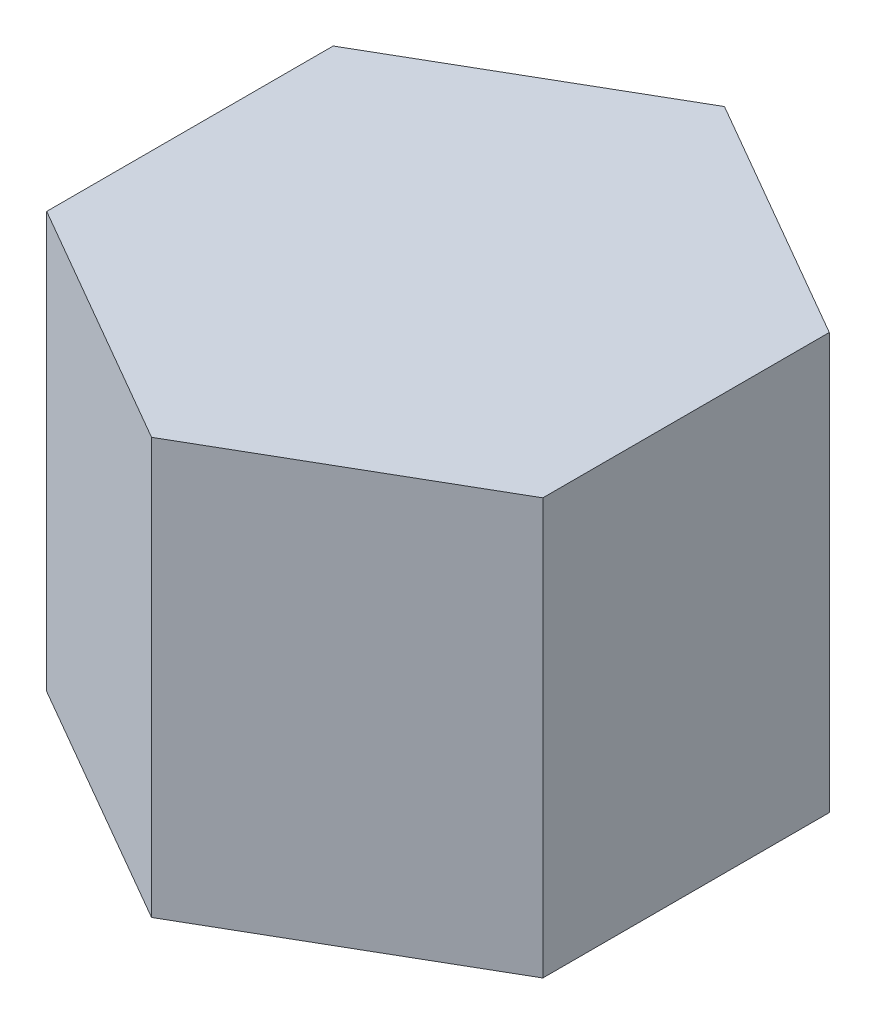
ISO-10303-21;
HEADER;
FILE_DESCRIPTION(('STEP AP214'),'2;1');
FILE_NAME('part.step','',(''),(''),'','','');
FILE_SCHEMA(('AUTOMOTIVE_DESIGN { 1 0 10303 214 1 1 1 1 }'));
ENDSEC;
DATA;
#1=APPLICATION_CONTEXT('core data for automotive mechanical design processes');
#2=APPLICATION_PROTOCOL_DEFINITION('international standard','automotive_design',2000,#1);
#3=PRODUCT_CONTEXT('',#1,'mechanical');
#4=PRODUCT('Part','Part','',(#3));
#5=PRODUCT_RELATED_PRODUCT_CATEGORY('part','',(#4));
#6=PRODUCT_DEFINITION_FORMATION('','',#4);
#7=PRODUCT_DEFINITION_CONTEXT('part definition',#1,'design');
#8=PRODUCT_DEFINITION('design','',#6,#7);
#9=PRODUCT_DEFINITION_SHAPE('','',#8);
#10=(LENGTH_UNIT() NAMED_UNIT(*) SI_UNIT(.MILLI.,.METRE.));
#11=(NAMED_UNIT(*) PLANE_ANGLE_UNIT() SI_UNIT($,.RADIAN.));
#12=(NAMED_UNIT(*) SI_UNIT($,.STERADIAN.) SOLID_ANGLE_UNIT());
#13=UNCERTAINTY_MEASURE_WITH_UNIT(LENGTH_MEASURE(1.E-05),#10,'distance_accuracy_value','');
#14=(GEOMETRIC_REPRESENTATION_CONTEXT(3) GLOBAL_UNCERTAINTY_ASSIGNED_CONTEXT((#13)) GLOBAL_UNIT_ASSIGNED_CONTEXT((#10,
#11,#12)) REPRESENTATION_CONTEXT('',''));
#15=CARTESIAN_POINT('',(0.,0.,0.));
#16=DIRECTION('',(0.,0.,1.));
#17=DIRECTION('',(1.,0.,0.));
#18=AXIS2_PLACEMENT_3D('',#15,#16,#17);
#19=CARTESIAN_POINT('',(202.642660308706,-148.537700895744,293.239022028063));
#20=DIRECTION('',(-0.500000000000028,0.,-0.866025403784423));
#21=DIRECTION('',(-0.866025403784423,0.,0.500000000000028));
#22=AXIS2_PLACEMENT_3D('',#19,#20,#21);
#23=PLANE('',#22);
#24=CARTESIAN_POINT('',(202.339551417382,-149.045793579175,293.414022028063));
#25=DIRECTION('',(0.866025403784422,0.,-0.500000000000028));
#26=VECTOR('',#25,1.);
#27=LINE('',#24,#26);
#28=CARTESIAN_POINT('',(202.339551417382,-149.045793579175,293.414022028063));
#29=VERTEX_POINT('',#28);
#30=CARTESIAN_POINT('',(202.642660308706,-149.045793579175,293.239022028063));
#31=VERTEX_POINT('',#30);
#32=EDGE_CURVE('E170',#29,#31,#27,.T.);
#33=ORIENTED_EDGE('',*,*,#32,.T.);
#34=CARTESIAN_POINT('',(202.642660308706,-148.537700895744,293.239022028063));
#35=DIRECTION('',(0.,-1.,0.));
#36=VECTOR('',#35,1.);
#37=LINE('',#34,#36);
#38=CARTESIAN_POINT('',(202.642660308706,-148.537700895744,293.239022028063));
#39=VERTEX_POINT('',#38);
#40=EDGE_CURVE('E35',#39,#31,#37,.T.);
#41=ORIENTED_EDGE('',*,*,#40,.F.);
#42=CARTESIAN_POINT('',(202.339551417382,-148.537700895744,293.414022028063));
#43=DIRECTION('',(0.866025403784422,0.,-0.500000000000028));
#44=VECTOR('',#43,1.);
#45=LINE('',#42,#44);
#46=CARTESIAN_POINT('',(202.339551417382,-148.537700895744,293.414022028063));
#47=VERTEX_POINT('',#46);
#48=EDGE_CURVE('E159',#47,#39,#45,.T.);
#49=ORIENTED_EDGE('',*,*,#48,.F.);
#50=CARTESIAN_POINT('',(202.339551417382,-148.537700895744,293.414022028063));
#51=DIRECTION('',(0.,-1.,0.));
#52=VECTOR('',#51,1.);
#53=LINE('',#50,#52);
#54=EDGE_CURVE('E10',#47,#29,#53,.T.);
#55=ORIENTED_EDGE('',*,*,#54,.T.);
#56=EDGE_LOOP('',(#33,#41,#49,#55));
#57=FACE_BOUND('',#56,.T.);
#58=ADVANCED_FACE('F16',(#57),#23,.F.);
#59=CARTESIAN_POINT('',(202.339551417382,-148.537700895744,293.414022028063));
#60=DIRECTION('',(0.499999999999978,0.,-0.866025403784452));
#61=DIRECTION('',(-0.866025403784452,0.,-0.499999999999978));
#62=AXIS2_PLACEMENT_3D('',#59,#60,#61);
#63=PLANE('',#62);
#64=CARTESIAN_POINT('',(202.036442526057,-149.045793579175,293.239022028063));
#65=DIRECTION('',(0.866025403784452,0.,0.499999999999978));
#66=VECTOR('',#65,1.);
#67=LINE('',#64,#66);
#68=CARTESIAN_POINT('',(202.036442526057,-149.045793579175,293.239022028063));
#69=VERTEX_POINT('',#68);
#70=EDGE_CURVE('E167',#69,#29,#67,.T.);
#71=ORIENTED_EDGE('',*,*,#70,.T.);
#72=ORIENTED_EDGE('',*,*,#54,.F.);
#73=CARTESIAN_POINT('',(202.036442526057,-148.537700895744,293.239022028063));
#74=DIRECTION('',(0.866025403784452,0.,0.499999999999978));
#75=VECTOR('',#74,1.);
#76=LINE('',#73,#75);
#77=CARTESIAN_POINT('',(202.036442526057,-148.537700895744,293.239022028063));
#78=VERTEX_POINT('',#77);
#79=EDGE_CURVE('E156',#78,#47,#76,.T.);
#80=ORIENTED_EDGE('',*,*,#79,.F.);
#81=CARTESIAN_POINT('',(202.036442526057,-148.537700895744,293.239022028063));
#82=DIRECTION('',(0.,-1.,0.));
#83=VECTOR('',#82,1.);
#84=LINE('',#81,#83);
#85=EDGE_CURVE('E27',#78,#69,#84,.T.);
#86=ORIENTED_EDGE('',*,*,#85,.T.);
#87=EDGE_LOOP('',(#71,#72,#80,#86));
#88=FACE_BOUND('',#87,.T.);
#89=ADVANCED_FACE('F189',(#88),#63,.F.);
#90=CARTESIAN_POINT('',(202.036442526057,-148.537700895744,290.831971220494));
#91=DIRECTION('',(1.,0.,0.));
#92=DIRECTION('',(0.,1.,0.));
#93=AXIS2_PLACEMENT_3D('',#90,#91,#92);
#94=PLANE('',#93);
#95=CARTESIAN_POINT('',(202.036442526057,-149.045793579175,292.889022028063));
#96=DIRECTION('',(0.,0.,1.));
#97=VECTOR('',#96,1.);
#98=LINE('',#95,#97);
#99=CARTESIAN_POINT('',(202.036442526057,-149.045793579175,292.889022028063));
#100=VERTEX_POINT('',#99);
#101=EDGE_CURVE('E163',#100,#69,#98,.T.);
#102=ORIENTED_EDGE('',*,*,#101,.T.);
#103=ORIENTED_EDGE('',*,*,#85,.F.);
#104=CARTESIAN_POINT('',(202.036442526057,-148.537700895744,292.889022028063));
#105=DIRECTION('',(0.,0.,1.));
#106=VECTOR('',#105,1.);
#107=LINE('',#104,#106);
#108=CARTESIAN_POINT('',(202.036442526057,-148.537700895744,292.889022028063));
#109=VERTEX_POINT('',#108);
#110=EDGE_CURVE('E106',#109,#78,#107,.T.);
#111=ORIENTED_EDGE('',*,*,#110,.F.);
#112=CARTESIAN_POINT('',(202.036442526057,-148.537700895744,292.889022028063));
#113=DIRECTION('',(0.,-1.,0.));
#114=VECTOR('',#113,1.);
#115=LINE('',#112,#114);
#116=EDGE_CURVE('E94',#109,#100,#115,.T.);
#117=ORIENTED_EDGE('',*,*,#116,.T.);
#118=EDGE_LOOP('',(#102,#103,#111,#117));
#119=FACE_BOUND('',#118,.T.);
#120=ADVANCED_FACE('F198',(#119),#94,.F.);
#121=CARTESIAN_POINT('',(202.036442526057,-148.537700895744,292.889022028063));
#122=DIRECTION('',(0.499999999999943,0.,0.866025403784472));
#123=DIRECTION('',(0.866025403784472,0.,-0.499999999999943));
#124=AXIS2_PLACEMENT_3D('',#121,#122,#123);
#125=PLANE('',#124);
#126=CARTESIAN_POINT('',(202.339551417382,-149.045793579175,292.714022028063));
#127=DIRECTION('',(-0.866025403784471,0.,0.499999999999943));
#128=VECTOR('',#127,1.);
#129=LINE('',#126,#128);
#130=CARTESIAN_POINT('',(202.339551417382,-149.045793579175,292.714022028063));
#131=VERTEX_POINT('',#130);
#132=EDGE_CURVE('E162',#131,#100,#129,.T.);
#133=ORIENTED_EDGE('',*,*,#132,.T.);
#134=ORIENTED_EDGE('',*,*,#116,.F.);
#135=CARTESIAN_POINT('',(202.339551417382,-148.537700895744,292.714022028063));
#136=DIRECTION('',(-0.866025403784471,0.,0.499999999999943));
#137=VECTOR('',#136,1.);
#138=LINE('',#135,#137);
#139=CARTESIAN_POINT('',(202.339551417382,-148.537700895744,292.714022028063));
#140=VERTEX_POINT('',#139);
#141=EDGE_CURVE('E98',#140,#109,#138,.T.);
#142=ORIENTED_EDGE('',*,*,#141,.F.);
#143=CARTESIAN_POINT('',(202.339551417382,-148.537700895744,292.714022028063));
#144=DIRECTION('',(0.,-1.,0.));
#145=VECTOR('',#144,1.);
#146=LINE('',#143,#145);
#147=EDGE_CURVE('E79',#140,#131,#146,.T.);
#148=ORIENTED_EDGE('',*,*,#147,.T.);
#149=EDGE_LOOP('',(#133,#134,#142,#148));
#150=FACE_BOUND('',#149,.T.);
#151=ADVANCED_FACE('F100',(#150),#125,.F.);
#152=CARTESIAN_POINT('',(202.339551417381,-148.537700895744,292.714022028063));
#153=DIRECTION('',(-0.500000000000028,0.,0.866025403784423));
#154=DIRECTION('',(0.866025403784423,0.,0.500000000000028));
#155=AXIS2_PLACEMENT_3D('',#152,#153,#154);
#156=PLANE('',#155);
#157=CARTESIAN_POINT('',(202.642660308706,-149.045793579175,292.889022028063));
#158=DIRECTION('',(-0.866025403784422,0.,-0.500000000000028));
#159=VECTOR('',#158,1.);
#160=LINE('',#157,#159);
#161=CARTESIAN_POINT('',(202.642660308706,-149.045793579175,292.889022028063));
#162=VERTEX_POINT('',#161);
#163=EDGE_CURVE('E88',#162,#131,#160,.T.);
#164=ORIENTED_EDGE('',*,*,#163,.T.);
#165=ORIENTED_EDGE('',*,*,#147,.F.);
#166=CARTESIAN_POINT('',(202.642660308706,-148.537700895744,292.889022028063));
#167=DIRECTION('',(-0.866025403784422,0.,-0.500000000000028));
#168=VECTOR('',#167,1.);
#169=LINE('',#166,#168);
#170=CARTESIAN_POINT('',(202.642660308706,-148.537700895744,292.889022028063));
#171=VERTEX_POINT('',#170);
#172=EDGE_CURVE('E84',#171,#140,#169,.T.);
#173=ORIENTED_EDGE('',*,*,#172,.F.);
#174=CARTESIAN_POINT('',(202.642660308706,-148.537700895744,292.889022028063));
#175=DIRECTION('',(0.,-1.,0.));
#176=VECTOR('',#175,1.);
#177=LINE('',#174,#176);
#178=EDGE_CURVE('E58',#171,#162,#177,.T.);
#179=ORIENTED_EDGE('',*,*,#178,.T.);
#180=EDGE_LOOP('',(#164,#165,#173,#179));
#181=FACE_BOUND('',#180,.T.);
#182=ADVANCED_FACE('F82',(#181),#156,.F.);
#183=CARTESIAN_POINT('',(202.642660308706,-148.537700895744,290.831971220494));
#184=DIRECTION('',(-1.,0.,0.));
#185=DIRECTION('',(0.,-1.,0.));
#186=AXIS2_PLACEMENT_3D('',#183,#184,#185);
#187=PLANE('',#186);
#188=CARTESIAN_POINT('',(202.642660308706,-149.045793579175,293.239022028063));
#189=DIRECTION('',(0.,0.,-1.));
#190=VECTOR('',#189,1.);
#191=LINE('',#188,#190);
#192=EDGE_CURVE('E160',#31,#162,#191,.T.);
#193=ORIENTED_EDGE('',*,*,#192,.T.);
#194=ORIENTED_EDGE('',*,*,#178,.F.);
#195=CARTESIAN_POINT('',(202.642660308706,-148.537700895744,293.239022028063));
#196=DIRECTION('',(0.,0.,-1.));
#197=VECTOR('',#196,1.);
#198=LINE('',#195,#197);
#199=EDGE_CURVE('E112',#39,#171,#198,.T.);
#200=ORIENTED_EDGE('',*,*,#199,.F.);
#201=ORIENTED_EDGE('',*,*,#40,.T.);
#202=EDGE_LOOP('',(#193,#194,#200,#201));
#203=FACE_BOUND('',#202,.T.);
#204=ADVANCED_FACE('F131',(#203),#187,.F.);
#205=CARTESIAN_POINT('',(206.339551417382,-148.537700895744,290.831971220494));
#206=DIRECTION('',(0.,-1.,0.));
#207=DIRECTION('',(1.,0.,0.));
#208=AXIS2_PLACEMENT_3D('',#205,#206,#207);
#209=PLANE('',#208);
#210=ORIENTED_EDGE('',*,*,#48,.T.);
#211=ORIENTED_EDGE('',*,*,#199,.T.);
#212=ORIENTED_EDGE('',*,*,#172,.T.);
#213=ORIENTED_EDGE('',*,*,#141,.T.);
#214=ORIENTED_EDGE('',*,*,#110,.T.);
#215=ORIENTED_EDGE('',*,*,#79,.T.);
#216=EDGE_LOOP('',(#210,#211,#212,#213,#214,#215));
#217=FACE_BOUND('',#216,.T.);
#218=ADVANCED_FACE('F111',(#217),#209,.F.);
#219=CARTESIAN_POINT('',(206.339551417382,-149.045793579175,290.831971220494));
#220=DIRECTION('',(0.,-1.,0.));
#221=DIRECTION('',(1.,0.,0.));
#222=AXIS2_PLACEMENT_3D('',#219,#220,#221);
#223=PLANE('',#222);
#224=ORIENTED_EDGE('',*,*,#32,.F.);
#225=ORIENTED_EDGE('',*,*,#70,.F.);
#226=ORIENTED_EDGE('',*,*,#101,.F.);
#227=ORIENTED_EDGE('',*,*,#132,.F.);
#228=ORIENTED_EDGE('',*,*,#163,.F.);
#229=ORIENTED_EDGE('',*,*,#192,.F.);
#230=EDGE_LOOP('',(#224,#225,#226,#227,#228,#229));
#231=FACE_BOUND('',#230,.T.);
#232=ADVANCED_FACE('F130',(#231),#223,.T.);
#233=CLOSED_SHELL('',(#58,#89,#120,#151,#182,#204,#218,#232));
#234=MANIFOLD_SOLID_BREP('B1',#233);
#235=ADVANCED_BREP_SHAPE_REPRESENTATION('',(#18,#234),#14);
#236=SHAPE_DEFINITION_REPRESENTATION(#9,#235);
ENDSEC;
END-ISO-10303-21;
